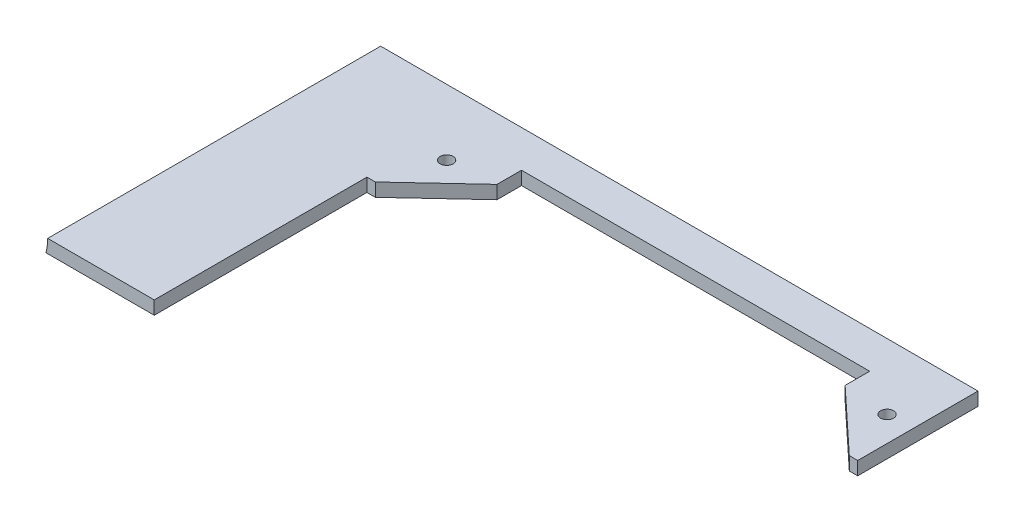
ISO-10303-21;
HEADER;
FILE_DESCRIPTION(('STEP AP214'),'2;1');
FILE_NAME('part.step','',(''),(''),'','','');
FILE_SCHEMA(('AUTOMOTIVE_DESIGN { 1 0 10303 214 1 1 1 1 }'));
ENDSEC;
DATA;
#1=APPLICATION_CONTEXT('core data for automotive mechanical design processes');
#2=APPLICATION_PROTOCOL_DEFINITION('international standard','automotive_design',2000,#1);
#3=PRODUCT_CONTEXT('',#1,'mechanical');
#4=PRODUCT('Part','Part','',(#3));
#5=PRODUCT_RELATED_PRODUCT_CATEGORY('part','',(#4));
#6=PRODUCT_DEFINITION_FORMATION('','',#4);
#7=PRODUCT_DEFINITION_CONTEXT('part definition',#1,'design');
#8=PRODUCT_DEFINITION('design','',#6,#7);
#9=PRODUCT_DEFINITION_SHAPE('','',#8);
#10=(LENGTH_UNIT() NAMED_UNIT(*) SI_UNIT(.MILLI.,.METRE.));
#11=(NAMED_UNIT(*) PLANE_ANGLE_UNIT() SI_UNIT($,.RADIAN.));
#12=(NAMED_UNIT(*) SI_UNIT($,.STERADIAN.) SOLID_ANGLE_UNIT());
#13=UNCERTAINTY_MEASURE_WITH_UNIT(LENGTH_MEASURE(1.E-05),#10,'distance_accuracy_value','');
#14=(GEOMETRIC_REPRESENTATION_CONTEXT(3) GLOBAL_UNCERTAINTY_ASSIGNED_CONTEXT((#13)) GLOBAL_UNIT_ASSIGNED_CONTEXT((#10,
#11,#12)) REPRESENTATION_CONTEXT('',''));
#15=CARTESIAN_POINT('',(0.,0.,0.));
#16=DIRECTION('',(0.,0.,1.));
#17=DIRECTION('',(1.,0.,0.));
#18=AXIS2_PLACEMENT_3D('',#15,#16,#17);
#19=CARTESIAN_POINT('',(0.,3.175,0.));
#20=DIRECTION('',(0.,-1.,0.));
#21=DIRECTION('',(0.,0.,-1.));
#22=AXIS2_PLACEMENT_3D('',#19,#20,#21);
#23=PLANE('',#22);
#24=CARTESIAN_POINT('',(-52.505245515811,3.175,-25.6052455158436));
#25=DIRECTION('',(0.,1.,0.));
#26=DIRECTION('',(0.,0.,1.));
#27=AXIS2_PLACEMENT_3D('',#24,#25,#26);
#28=CIRCLE('',#27,1.54533666301317);
#29=CARTESIAN_POINT('',(-52.505245515811,3.175,-24.0599088528304));
#30=VERTEX_POINT('',#29);
#31=EDGE_CURVE('E294',#30,#30,#28,.T.);
#32=ORIENTED_EDGE('',*,*,#31,.F.);
#33=EDGE_LOOP('',(#32));
#34=FACE_BOUND('',#33,.T.);
#35=CARTESIAN_POINT('',(52.5000000000001,3.175,-25.6052455158436));
#36=DIRECTION('',(0.,1.,0.));
#37=DIRECTION('',(0.,0.,1.));
#38=AXIS2_PLACEMENT_3D('',#35,#36,#37);
#39=CIRCLE('',#38,1.54533666301317);
#40=CARTESIAN_POINT('',(52.5000000000001,3.175,-24.0599088528304));
#41=VERTEX_POINT('',#40);
#42=EDGE_CURVE('E301',#41,#41,#39,.T.);
#43=ORIENTED_EDGE('',*,*,#42,.F.);
#44=EDGE_LOOP('',(#43));
#45=FACE_BOUND('',#44,.T.);
#46=DIRECTION('',(0.,0.,-1.));
#47=VECTOR('',#46,1.);
#48=CARTESIAN_POINT('',(-83.8999999999999,3.175,467.88391263662));
#49=LINE('',#48,#47);
#50=CARTESIAN_POINT('',(-83.9000000000001,3.175,38.1));
#51=VERTEX_POINT('',#50);
#52=CARTESIAN_POINT('',(-83.9000000000001,3.17500000007381,-36.6546307938385));
#53=VERTEX_POINT('',#52);
#54=EDGE_CURVE('E267',#51,#53,#49,.T.);
#55=ORIENTED_EDGE('',*,*,#54,.F.);
#56=DIRECTION('',(1.,0.,0.));
#57=VECTOR('',#56,1.);
#58=CARTESIAN_POINT('',(-95.25,3.175,38.1));
#59=LINE('',#58,#57);
#60=CARTESIAN_POINT('',(-58.4999999999998,3.175,38.1));
#61=VERTEX_POINT('',#60);
#62=EDGE_CURVE('E369',#51,#61,#59,.T.);
#63=ORIENTED_EDGE('',*,*,#62,.T.);
#64=DIRECTION('',(0.,0.,1.));
#65=VECTOR('',#64,1.);
#66=CARTESIAN_POINT('',(-58.4999999999998,3.175,0.));
#67=LINE('',#66,#65);
#68=CARTESIAN_POINT('',(-58.4999999999998,3.175,-12.6000000000291));
#69=VERTEX_POINT('',#68);
#70=EDGE_CURVE('E330',#69,#61,#67,.T.);
#71=ORIENTED_EDGE('',*,*,#70,.F.);
#72=DIRECTION('',(-1.,0.,0.));
#73=VECTOR('',#72,1.);
#74=CARTESIAN_POINT('',(0.,3.175,-12.6000000000289));
#75=LINE('',#74,#73);
#76=CARTESIAN_POINT('',(-56.4999999999998,3.175,-12.6000000000291));
#77=VERTEX_POINT('',#76);
#78=EDGE_CURVE('E297',#77,#69,#75,.T.);
#79=ORIENTED_EDGE('',*,*,#78,.F.);
#80=DIRECTION('',(0.731055268242868,0.,-0.682318250360012));
#81=VECTOR('',#80,1.);
#82=CARTESIAN_POINT('',(-32.5890736342187,3.175,-34.9168646080915));
#83=LINE('',#82,#81);
#84=CARTESIAN_POINT('',(-41.4999999999998,3.175,-26.6000000000291));
#85=VERTEX_POINT('',#84);
#86=EDGE_CURVE('E310',#77,#85,#83,.T.);
#87=ORIENTED_EDGE('',*,*,#86,.T.);
#88=DIRECTION('',(0.,0.,-1.));
#89=VECTOR('',#88,1.);
#90=CARTESIAN_POINT('',(-41.4999999999998,3.175,0.));
#91=LINE('',#90,#89);
#92=CARTESIAN_POINT('',(-41.4999999999998,3.175,-32.4500000000291));
#93=VERTEX_POINT('',#92);
#94=EDGE_CURVE('E347',#85,#93,#91,.T.);
#95=ORIENTED_EDGE('',*,*,#94,.T.);
#96=DIRECTION('',(1.,0.,0.));
#97=VECTOR('',#96,1.);
#98=CARTESIAN_POINT('',(0.,3.175,-32.4500000000291));
#99=LINE('',#98,#97);
#100=CARTESIAN_POINT('',(41.5000000000002,3.175,-32.4500000000291));
#101=VERTEX_POINT('',#100);
#102=EDGE_CURVE('E344',#93,#101,#99,.T.);
#103=ORIENTED_EDGE('',*,*,#102,.T.);
#104=DIRECTION('',(0.,0.,1.));
#105=VECTOR('',#104,1.);
#106=CARTESIAN_POINT('',(41.5000000000002,3.175,0.));
#107=LINE('',#106,#105);
#108=CARTESIAN_POINT('',(41.5000000000002,3.175,-26.6000000000291));
#109=VERTEX_POINT('',#108);
#110=EDGE_CURVE('E341',#101,#109,#107,.T.);
#111=ORIENTED_EDGE('',*,*,#110,.T.);
#112=DIRECTION('',(0.731055268242869,0.,0.682318250360011));
#113=VECTOR('',#112,1.);
#114=CARTESIAN_POINT('',(32.5890736342188,3.175,-34.9168646080917));
#115=LINE('',#114,#113);
#116=CARTESIAN_POINT('',(56.5000000000002,3.175,-12.6000000000291));
#117=VERTEX_POINT('',#116);
#118=EDGE_CURVE('E338',#109,#117,#115,.T.);
#119=ORIENTED_EDGE('',*,*,#118,.T.);
#120=DIRECTION('',(1.,0.,0.));
#121=VECTOR('',#120,1.);
#122=CARTESIAN_POINT('',(0.,3.175,-12.6000000000291));
#123=LINE('',#122,#121);
#124=CARTESIAN_POINT('',(58.5000000000002,3.175,-12.6000000000291));
#125=VERTEX_POINT('',#124);
#126=EDGE_CURVE('E335',#117,#125,#123,.T.);
#127=ORIENTED_EDGE('',*,*,#126,.T.);
#128=DIRECTION('',(0.,0.,-1.));
#129=VECTOR('',#128,1.);
#130=CARTESIAN_POINT('',(58.5000000000002,3.175,0.));
#131=LINE('',#130,#129);
#132=CARTESIAN_POINT('',(58.5000000000002,3.175,-41.275));
#133=VERTEX_POINT('',#132);
#134=EDGE_CURVE('E333',#125,#133,#131,.T.);
#135=ORIENTED_EDGE('',*,*,#134,.T.);
#136=DIRECTION('',(1.,0.,0.));
#137=VECTOR('',#136,1.);
#138=CARTESIAN_POINT('',(-95.25,3.175,-41.275));
#139=LINE('',#138,#137);
#140=CARTESIAN_POINT('',(-83.9000000000002,3.175,-41.275));
#141=VERTEX_POINT('',#140);
#142=EDGE_CURVE('E273',#141,#133,#139,.T.);
#143=ORIENTED_EDGE('',*,*,#142,.F.);
#144=DIRECTION('',(0.,0.,-1.));
#145=VECTOR('',#144,1.);
#146=CARTESIAN_POINT('',(-83.9000000000002,3.175,-36.6546307938385));
#147=LINE('',#146,#145);
#148=EDGE_CURVE('E185',#53,#141,#147,.T.);
#149=ORIENTED_EDGE('',*,*,#148,.F.);
#150=EDGE_LOOP('',(#55,#63,#71,#79,#87,#95,#103,#111,#119,#127,#135,#143,#149));
#151=FACE_BOUND('',#150,.T.);
#152=ADVANCED_FACE('F170',(#34,#45,#151),#23,.F.);
#153=CARTESIAN_POINT('',(0.,0.,0.));
#154=DIRECTION('',(0.,-1.,0.));
#155=DIRECTION('',(0.,0.,-1.));
#156=AXIS2_PLACEMENT_3D('',#153,#154,#155);
#157=PLANE('',#156);
#158=CARTESIAN_POINT('',(52.5000000000001,0.,-25.6052455158436));
#159=DIRECTION('',(0.,1.,0.));
#160=DIRECTION('',(0.,0.,1.));
#161=AXIS2_PLACEMENT_3D('',#158,#159,#160);
#162=CIRCLE('',#161,1.54533666301317);
#163=CARTESIAN_POINT('',(52.5000000000001,0.,-24.0599088528304));
#164=VERTEX_POINT('',#163);
#165=EDGE_CURVE('E293',#164,#164,#162,.T.);
#166=ORIENTED_EDGE('',*,*,#165,.T.);
#167=EDGE_LOOP('',(#166));
#168=FACE_BOUND('',#167,.T.);
#169=CARTESIAN_POINT('',(-52.505245515811,0.,-25.6052455158436));
#170=DIRECTION('',(0.,1.,0.));
#171=DIRECTION('',(0.,0.,1.));
#172=AXIS2_PLACEMENT_3D('',#169,#170,#171);
#173=CIRCLE('',#172,1.54533666301317);
#174=CARTESIAN_POINT('',(-52.505245515811,0.,-24.0599088528304));
#175=VERTEX_POINT('',#174);
#176=EDGE_CURVE('E298',#175,#175,#173,.T.);
#177=ORIENTED_EDGE('',*,*,#176,.T.);
#178=EDGE_LOOP('',(#177));
#179=FACE_BOUND('',#178,.T.);
#180=DIRECTION('',(1.,0.,0.));
#181=VECTOR('',#180,1.);
#182=CARTESIAN_POINT('',(-95.25,0.,38.1));
#183=LINE('',#182,#181);
#184=CARTESIAN_POINT('',(-84.3032778758106,0.,38.1));
#185=VERTEX_POINT('',#184);
#186=CARTESIAN_POINT('',(-58.4999999999998,0.,38.1));
#187=VERTEX_POINT('',#186);
#188=EDGE_CURVE('E193',#185,#187,#183,.T.);
#189=ORIENTED_EDGE('',*,*,#188,.F.);
#190=DIRECTION('',(0.,0.,-1.));
#191=VECTOR('',#190,1.);
#192=CARTESIAN_POINT('',(-84.3032778758104,0.,467.88391263662));
#193=LINE('',#192,#191);
#194=CARTESIAN_POINT('',(-84.3032778758106,0.,-36.6546307938385));
#195=VERTEX_POINT('',#194);
#196=EDGE_CURVE('E274',#185,#195,#193,.T.);
#197=ORIENTED_EDGE('',*,*,#196,.T.);
#198=DIRECTION('',(0.,0.,-1.));
#199=VECTOR('',#198,1.);
#200=CARTESIAN_POINT('',(-84.3032778758107,0.,-36.6546307938385));
#201=LINE('',#200,#199);
#202=CARTESIAN_POINT('',(-84.3032778758107,0.,-41.275));
#203=VERTEX_POINT('',#202);
#204=EDGE_CURVE('E278',#195,#203,#201,.T.);
#205=ORIENTED_EDGE('',*,*,#204,.T.);
#206=DIRECTION('',(-1.,0.,0.));
#207=VECTOR('',#206,1.);
#208=CARTESIAN_POINT('',(58.5000000000002,0.,-41.275));
#209=LINE('',#208,#207);
#210=CARTESIAN_POINT('',(58.5000000000002,0.,-41.275));
#211=VERTEX_POINT('',#210);
#212=EDGE_CURVE('E290',#211,#203,#209,.T.);
#213=ORIENTED_EDGE('',*,*,#212,.F.);
#214=DIRECTION('',(0.,0.,-1.));
#215=VECTOR('',#214,1.);
#216=CARTESIAN_POINT('',(58.5000000000002,0.,0.));
#217=LINE('',#216,#215);
#218=CARTESIAN_POINT('',(58.5000000000002,0.,-12.6000000000291));
#219=VERTEX_POINT('',#218);
#220=EDGE_CURVE('E313',#219,#211,#217,.T.);
#221=ORIENTED_EDGE('',*,*,#220,.F.);
#222=DIRECTION('',(1.,0.,0.));
#223=VECTOR('',#222,1.);
#224=CARTESIAN_POINT('',(0.,0.,-12.6000000000291));
#225=LINE('',#224,#223);
#226=CARTESIAN_POINT('',(56.5000000000002,0.,-12.6000000000291));
#227=VERTEX_POINT('',#226);
#228=EDGE_CURVE('E315',#227,#219,#225,.T.);
#229=ORIENTED_EDGE('',*,*,#228,.F.);
#230=DIRECTION('',(0.731055268242869,0.,0.682318250360011));
#231=VECTOR('',#230,1.);
#232=CARTESIAN_POINT('',(32.5890736342188,0.,-34.9168646080917));
#233=LINE('',#232,#231);
#234=CARTESIAN_POINT('',(41.5000000000002,0.,-26.6000000000291));
#235=VERTEX_POINT('',#234);
#236=EDGE_CURVE('E317',#235,#227,#233,.T.);
#237=ORIENTED_EDGE('',*,*,#236,.F.);
#238=DIRECTION('',(0.,0.,1.));
#239=VECTOR('',#238,1.);
#240=CARTESIAN_POINT('',(41.5000000000002,0.,0.));
#241=LINE('',#240,#239);
#242=CARTESIAN_POINT('',(41.5000000000002,0.,-32.4500000000291));
#243=VERTEX_POINT('',#242);
#244=EDGE_CURVE('E319',#243,#235,#241,.T.);
#245=ORIENTED_EDGE('',*,*,#244,.F.);
#246=DIRECTION('',(1.,0.,0.));
#247=VECTOR('',#246,1.);
#248=CARTESIAN_POINT('',(0.,0.,-32.4500000000291));
#249=LINE('',#248,#247);
#250=CARTESIAN_POINT('',(-41.4999999999998,0.,-32.4500000000291));
#251=VERTEX_POINT('',#250);
#252=EDGE_CURVE('E321',#251,#243,#249,.T.);
#253=ORIENTED_EDGE('',*,*,#252,.F.);
#254=DIRECTION('',(0.,0.,-1.));
#255=VECTOR('',#254,1.);
#256=CARTESIAN_POINT('',(-41.4999999999998,0.,0.));
#257=LINE('',#256,#255);
#258=CARTESIAN_POINT('',(-41.4999999999998,0.,-26.6000000000291));
#259=VERTEX_POINT('',#258);
#260=EDGE_CURVE('E323',#259,#251,#257,.T.);
#261=ORIENTED_EDGE('',*,*,#260,.F.);
#262=DIRECTION('',(0.731055268242868,0.,-0.682318250360012));
#263=VECTOR('',#262,1.);
#264=CARTESIAN_POINT('',(-32.5890736342187,0.,-34.9168646080915));
#265=LINE('',#264,#263);
#266=CARTESIAN_POINT('',(-56.4999999999998,0.,-12.6000000000291));
#267=VERTEX_POINT('',#266);
#268=EDGE_CURVE('E325',#267,#259,#265,.T.);
#269=ORIENTED_EDGE('',*,*,#268,.F.);
#270=DIRECTION('',(-1.,0.,0.));
#271=VECTOR('',#270,1.);
#272=CARTESIAN_POINT('',(0.,0.,-12.6000000000289));
#273=LINE('',#272,#271);
#274=CARTESIAN_POINT('',(-58.4999999999998,0.,-12.6000000000291));
#275=VERTEX_POINT('',#274);
#276=EDGE_CURVE('E306',#267,#275,#273,.T.);
#277=ORIENTED_EDGE('',*,*,#276,.T.);
#278=DIRECTION('',(0.,0.,1.));
#279=VECTOR('',#278,1.);
#280=CARTESIAN_POINT('',(-58.4999999999998,0.,0.));
#281=LINE('',#280,#279);
#282=EDGE_CURVE('E309',#275,#187,#281,.T.);
#283=ORIENTED_EDGE('',*,*,#282,.T.);
#284=EDGE_LOOP('',(#189,#197,#205,#213,#221,#229,#237,#245,#253,#261,#269,#277,#283));
#285=FACE_BOUND('',#284,.T.);
#286=ADVANCED_FACE('F375',(#168,#179,#285),#157,.T.);
#287=CARTESIAN_POINT('',(-95.25,3.175,38.1));
#288=DIRECTION('',(0.,0.,-1.));
#289=DIRECTION('',(-1.,0.,0.));
#290=AXIS2_PLACEMENT_3D('',#287,#288,#289);
#291=PLANE('',#290);
#292=CARTESIAN_POINT('',(-96.6000000000001,3.17500000007377,38.1));
#293=DIRECTION('',(0.,0.,-1.));
#294=DIRECTION('',(-1.,0.,0.));
#295=AXIS2_PLACEMENT_3D('',#292,#293,#294);
#296=CIRCLE('',#295,12.7);
#297=EDGE_CURVE('E12',#185,#51,#296,.F.);
#298=ORIENTED_EDGE('',*,*,#297,.F.);
#299=ORIENTED_EDGE('',*,*,#188,.T.);
#300=DIRECTION('',(0.,1.,0.));
#301=VECTOR('',#300,1.);
#302=CARTESIAN_POINT('',(-58.4999999999998,0.,38.1));
#303=LINE('',#302,#301);
#304=EDGE_CURVE('E366',#187,#61,#303,.T.);
#305=ORIENTED_EDGE('',*,*,#304,.T.);
#306=ORIENTED_EDGE('',*,*,#62,.F.);
#307=EDGE_LOOP('',(#298,#299,#305,#306));
#308=FACE_BOUND('',#307,.T.);
#309=ADVANCED_FACE('F172',(#308),#291,.F.);
#310=CARTESIAN_POINT('',(0.,0.,-12.6000000000289));
#311=DIRECTION('',(0.,0.,-1.));
#312=DIRECTION('',(-1.,0.,0.));
#313=AXIS2_PLACEMENT_3D('',#310,#311,#312);
#314=PLANE('',#313);
#315=ORIENTED_EDGE('',*,*,#78,.T.);
#316=DIRECTION('',(0.,1.,0.));
#317=VECTOR('',#316,1.);
#318=CARTESIAN_POINT('',(-58.4999999999998,0.,-12.6000000000291));
#319=LINE('',#318,#317);
#320=EDGE_CURVE('E327',#275,#69,#319,.T.);
#321=ORIENTED_EDGE('',*,*,#320,.F.);
#322=ORIENTED_EDGE('',*,*,#276,.F.);
#323=DIRECTION('',(0.,1.,0.));
#324=VECTOR('',#323,1.);
#325=CARTESIAN_POINT('',(-56.4999999999998,0.,-12.6000000000291));
#326=LINE('',#325,#324);
#327=EDGE_CURVE('E352',#267,#77,#326,.T.);
#328=ORIENTED_EDGE('',*,*,#327,.T.);
#329=EDGE_LOOP('',(#315,#321,#322,#328));
#330=FACE_BOUND('',#329,.T.);
#331=ADVANCED_FACE('F384',(#330),#314,.F.);
#332=CARTESIAN_POINT('',(-32.5890736342187,0.,-34.9168646080915));
#333=DIRECTION('',(0.682318250360012,0.,0.731055268242868));
#334=DIRECTION('',(0.731055268242869,0.,-0.682318250360012));
#335=AXIS2_PLACEMENT_3D('',#332,#333,#334);
#336=PLANE('',#335);
#337=ORIENTED_EDGE('',*,*,#86,.F.);
#338=ORIENTED_EDGE('',*,*,#327,.F.);
#339=ORIENTED_EDGE('',*,*,#268,.T.);
#340=DIRECTION('',(0.,1.,0.));
#341=VECTOR('',#340,1.);
#342=CARTESIAN_POINT('',(-41.4999999999998,0.,-26.6000000000291));
#343=LINE('',#342,#341);
#344=EDGE_CURVE('E354',#259,#85,#343,.T.);
#345=ORIENTED_EDGE('',*,*,#344,.T.);
#346=EDGE_LOOP('',(#337,#338,#339,#345));
#347=FACE_BOUND('',#346,.T.);
#348=ADVANCED_FACE('F388',(#347),#336,.T.);
#349=CARTESIAN_POINT('',(-41.4999999999998,0.,0.));
#350=DIRECTION('',(1.,0.,0.));
#351=DIRECTION('',(0.,0.,-1.));
#352=AXIS2_PLACEMENT_3D('',#349,#350,#351);
#353=PLANE('',#352);
#354=ORIENTED_EDGE('',*,*,#94,.F.);
#355=ORIENTED_EDGE('',*,*,#344,.F.);
#356=ORIENTED_EDGE('',*,*,#260,.T.);
#357=DIRECTION('',(0.,1.,0.));
#358=VECTOR('',#357,1.);
#359=CARTESIAN_POINT('',(-41.4999999999998,0.,-32.4500000000291));
#360=LINE('',#359,#358);
#361=EDGE_CURVE('E356',#251,#93,#360,.T.);
#362=ORIENTED_EDGE('',*,*,#361,.T.);
#363=EDGE_LOOP('',(#354,#355,#356,#362));
#364=FACE_BOUND('',#363,.T.);
#365=ADVANCED_FACE('F393',(#364),#353,.T.);
#366=CARTESIAN_POINT('',(0.,0.,-32.4500000000291));
#367=DIRECTION('',(0.,0.,1.));
#368=DIRECTION('',(1.,0.,0.));
#369=AXIS2_PLACEMENT_3D('',#366,#367,#368);
#370=PLANE('',#369);
#371=ORIENTED_EDGE('',*,*,#102,.F.);
#372=ORIENTED_EDGE('',*,*,#361,.F.);
#373=ORIENTED_EDGE('',*,*,#252,.T.);
#374=DIRECTION('',(0.,1.,0.));
#375=VECTOR('',#374,1.);
#376=CARTESIAN_POINT('',(41.5000000000002,0.,-32.4500000000291));
#377=LINE('',#376,#375);
#378=EDGE_CURVE('E358',#243,#101,#377,.T.);
#379=ORIENTED_EDGE('',*,*,#378,.T.);
#380=EDGE_LOOP('',(#371,#372,#373,#379));
#381=FACE_BOUND('',#380,.T.);
#382=ADVANCED_FACE('F398',(#381),#370,.T.);
#383=CARTESIAN_POINT('',(41.5000000000002,0.,0.));
#384=DIRECTION('',(-1.,0.,0.));
#385=DIRECTION('',(0.,0.,1.));
#386=AXIS2_PLACEMENT_3D('',#383,#384,#385);
#387=PLANE('',#386);
#388=ORIENTED_EDGE('',*,*,#110,.F.);
#389=ORIENTED_EDGE('',*,*,#378,.F.);
#390=ORIENTED_EDGE('',*,*,#244,.T.);
#391=DIRECTION('',(0.,1.,0.));
#392=VECTOR('',#391,1.);
#393=CARTESIAN_POINT('',(41.5000000000002,0.,-26.6000000000291));
#394=LINE('',#393,#392);
#395=EDGE_CURVE('E360',#235,#109,#394,.T.);
#396=ORIENTED_EDGE('',*,*,#395,.T.);
#397=EDGE_LOOP('',(#388,#389,#390,#396));
#398=FACE_BOUND('',#397,.T.);
#399=ADVANCED_FACE('F403',(#398),#387,.T.);
#400=CARTESIAN_POINT('',(32.5890736342188,0.,-34.9168646080917));
#401=DIRECTION('',(-0.682318250360011,0.,0.731055268242869));
#402=DIRECTION('',(0.731055268242869,0.,0.682318250360011));
#403=AXIS2_PLACEMENT_3D('',#400,#401,#402);
#404=PLANE('',#403);
#405=ORIENTED_EDGE('',*,*,#118,.F.);
#406=ORIENTED_EDGE('',*,*,#395,.F.);
#407=ORIENTED_EDGE('',*,*,#236,.T.);
#408=DIRECTION('',(0.,1.,0.));
#409=VECTOR('',#408,1.);
#410=CARTESIAN_POINT('',(56.5000000000002,0.,-12.6000000000291));
#411=LINE('',#410,#409);
#412=EDGE_CURVE('E362',#227,#117,#411,.T.);
#413=ORIENTED_EDGE('',*,*,#412,.T.);
#414=EDGE_LOOP('',(#405,#406,#407,#413));
#415=FACE_BOUND('',#414,.T.);
#416=ADVANCED_FACE('F408',(#415),#404,.T.);
#417=CARTESIAN_POINT('',(0.,0.,-12.6000000000291));
#418=DIRECTION('',(0.,0.,1.));
#419=DIRECTION('',(1.,0.,0.));
#420=AXIS2_PLACEMENT_3D('',#417,#418,#419);
#421=PLANE('',#420);
#422=ORIENTED_EDGE('',*,*,#126,.F.);
#423=ORIENTED_EDGE('',*,*,#412,.F.);
#424=ORIENTED_EDGE('',*,*,#228,.T.);
#425=DIRECTION('',(0.,1.,0.));
#426=VECTOR('',#425,1.);
#427=CARTESIAN_POINT('',(58.5000000000002,0.,-12.6000000000291));
#428=LINE('',#427,#426);
#429=EDGE_CURVE('E364',#219,#125,#428,.T.);
#430=ORIENTED_EDGE('',*,*,#429,.T.);
#431=EDGE_LOOP('',(#422,#423,#424,#430));
#432=FACE_BOUND('',#431,.T.);
#433=ADVANCED_FACE('F413',(#432),#421,.T.);
#434=CARTESIAN_POINT('',(58.5000000000002,0.,0.));
#435=DIRECTION('',(1.,0.,0.));
#436=DIRECTION('',(0.,0.,-1.));
#437=AXIS2_PLACEMENT_3D('',#434,#435,#436);
#438=PLANE('',#437);
#439=ORIENTED_EDGE('',*,*,#134,.F.);
#440=ORIENTED_EDGE('',*,*,#429,.F.);
#441=ORIENTED_EDGE('',*,*,#220,.T.);
#442=DIRECTION('',(0.,-1.,0.));
#443=VECTOR('',#442,1.);
#444=CARTESIAN_POINT('',(58.5000000000002,3.175,-41.275));
#445=LINE('',#444,#443);
#446=EDGE_CURVE('E287',#133,#211,#445,.T.);
#447=ORIENTED_EDGE('',*,*,#446,.F.);
#448=EDGE_LOOP('',(#439,#440,#441,#447));
#449=FACE_BOUND('',#448,.T.);
#450=ADVANCED_FACE('F418',(#449),#438,.T.);
#451=CARTESIAN_POINT('',(-58.4999999999998,0.,0.));
#452=DIRECTION('',(-1.,0.,0.));
#453=DIRECTION('',(0.,0.,1.));
#454=AXIS2_PLACEMENT_3D('',#451,#452,#453);
#455=PLANE('',#454);
#456=ORIENTED_EDGE('',*,*,#70,.T.);
#457=ORIENTED_EDGE('',*,*,#304,.F.);
#458=ORIENTED_EDGE('',*,*,#282,.F.);
#459=ORIENTED_EDGE('',*,*,#320,.T.);
#460=EDGE_LOOP('',(#456,#457,#458,#459));
#461=FACE_BOUND('',#460,.T.);
#462=ADVANCED_FACE('F380',(#461),#455,.F.);
#463=CARTESIAN_POINT('',(-52.505245515811,0.,-25.6052455158436));
#464=DIRECTION('',(0.,1.,0.));
#465=DIRECTION('',(0.,0.,1.));
#466=AXIS2_PLACEMENT_3D('',#463,#464,#465);
#467=CYLINDRICAL_SURFACE('',#466,1.54533666301317);
#468=ORIENTED_EDGE('',*,*,#176,.F.);
#469=EDGE_LOOP('',(#468));
#470=FACE_BOUND('',#469,.T.);
#471=ORIENTED_EDGE('',*,*,#31,.T.);
#472=EDGE_LOOP('',(#471));
#473=FACE_BOUND('',#472,.T.);
#474=ADVANCED_FACE('F425',(#470,#473),#467,.F.);
#475=CARTESIAN_POINT('',(52.5000000000001,0.,-25.6052455158436));
#476=DIRECTION('',(0.,1.,0.));
#477=DIRECTION('',(0.,0.,1.));
#478=AXIS2_PLACEMENT_3D('',#475,#476,#477);
#479=CYLINDRICAL_SURFACE('',#478,1.54533666301317);
#480=ORIENTED_EDGE('',*,*,#165,.F.);
#481=EDGE_LOOP('',(#480));
#482=FACE_BOUND('',#481,.T.);
#483=ORIENTED_EDGE('',*,*,#42,.T.);
#484=EDGE_LOOP('',(#483));
#485=FACE_BOUND('',#484,.T.);
#486=ADVANCED_FACE('F470',(#482,#485),#479,.F.);
#487=CARTESIAN_POINT('',(0.,0.,-41.275));
#488=DIRECTION('',(0.,0.,-1.));
#489=DIRECTION('',(-1.,0.,0.));
#490=AXIS2_PLACEMENT_3D('',#487,#488,#489);
#491=PLANE('',#490);
#492=ORIENTED_EDGE('',*,*,#212,.T.);
#493=CARTESIAN_POINT('',(-96.6000000000002,3.17500000007392,-41.275));
#494=DIRECTION('',(0.,0.,-1.));
#495=DIRECTION('',(-1.,0.,0.));
#496=AXIS2_PLACEMENT_3D('',#493,#494,#495);
#497=CIRCLE('',#496,12.7);
#498=EDGE_CURVE('E178',#203,#141,#497,.F.);
#499=ORIENTED_EDGE('',*,*,#498,.T.);
#500=ORIENTED_EDGE('',*,*,#142,.T.);
#501=ORIENTED_EDGE('',*,*,#446,.T.);
#502=EDGE_LOOP('',(#492,#499,#500,#501));
#503=FACE_BOUND('',#502,.T.);
#504=ADVANCED_FACE('F372',(#503),#491,.T.);
#505=CARTESIAN_POINT('',(-96.6,3.17500000007353,467.88391263662));
#506=DIRECTION('',(0.,0.,-1.));
#507=DIRECTION('',(0.,1.,0.));
#508=AXIS2_PLACEMENT_3D('',#505,#506,#507);
#509=CYLINDRICAL_SURFACE('',#508,12.7);
#510=ORIENTED_EDGE('',*,*,#54,.T.);
#511=CARTESIAN_POINT('',(-96.6000000000001,3.17500000007381,-36.6546307938385));
#512=DIRECTION('',(0.,0.,1.));
#513=DIRECTION('',(1.,0.,0.));
#514=AXIS2_PLACEMENT_3D('',#511,#512,#513);
#515=CIRCLE('',#514,12.7);
#516=EDGE_CURVE('E269',#195,#53,#515,.T.);
#517=ORIENTED_EDGE('',*,*,#516,.F.);
#518=ORIENTED_EDGE('',*,*,#196,.F.);
#519=ORIENTED_EDGE('',*,*,#297,.T.);
#520=EDGE_LOOP('',(#510,#517,#518,#519));
#521=FACE_BOUND('',#520,.T.);
#522=ADVANCED_FACE('F268',(#521),#509,.F.);
#523=CARTESIAN_POINT('',(-96.6000000000002,3.17500000007392,-36.6546307938385));
#524=DIRECTION('',(0.,0.,-1.));
#525=DIRECTION('',(-1.,0.,0.));
#526=AXIS2_PLACEMENT_3D('',#523,#524,#525);
#527=CYLINDRICAL_SURFACE('',#526,12.7);
#528=ORIENTED_EDGE('',*,*,#148,.T.);
#529=ORIENTED_EDGE('',*,*,#498,.F.);
#530=ORIENTED_EDGE('',*,*,#204,.F.);
#531=ORIENTED_EDGE('',*,*,#516,.T.);
#532=EDGE_LOOP('',(#528,#529,#530,#531));
#533=FACE_BOUND('',#532,.T.);
#534=ADVANCED_FACE('F276',(#533),#527,.F.);
#535=CLOSED_SHELL('',(#152,#286,#309,#331,#348,#365,#382,#399,#416,#433,#450,#462,#474,#486,
#504,#522,#534));
#536=MANIFOLD_SOLID_BREP('B2',#535);
#537=ADVANCED_BREP_SHAPE_REPRESENTATION('',(#18,#536),#14);
#538=SHAPE_DEFINITION_REPRESENTATION(#9,#537);
ENDSEC;
END-ISO-10303-21;
